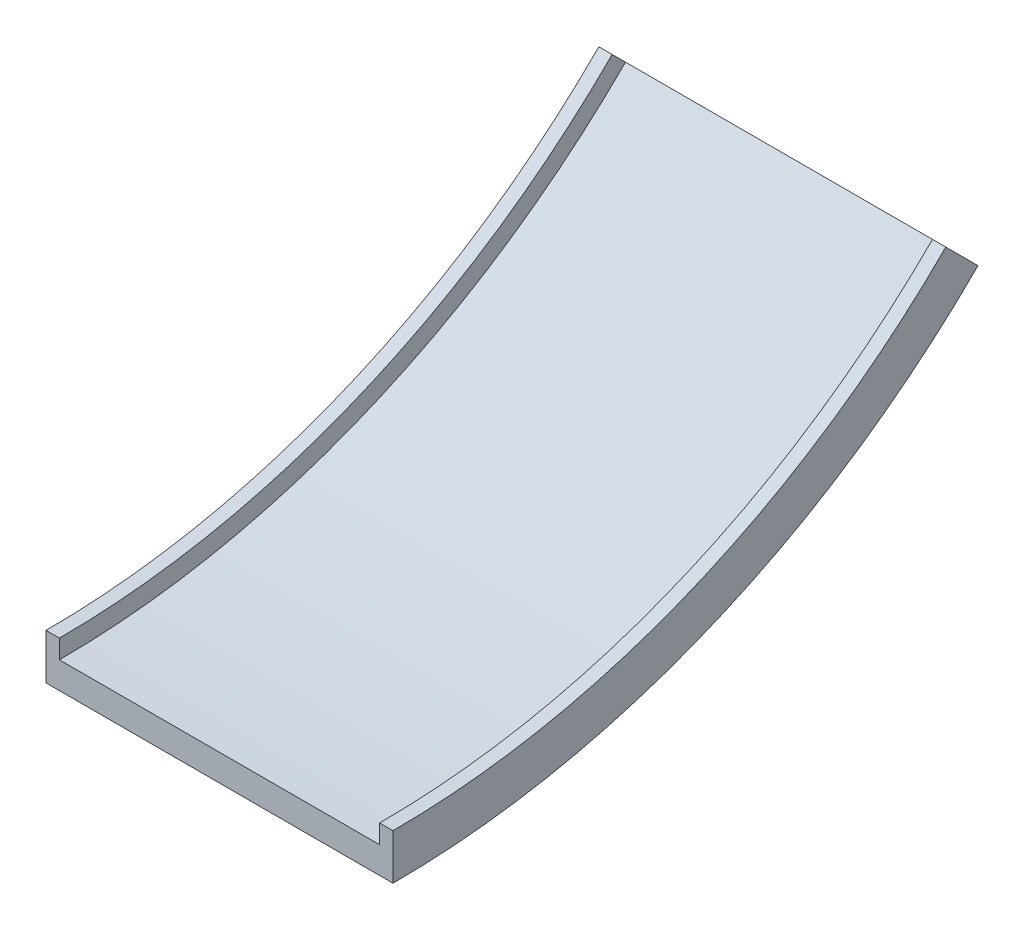
ISO-10303-21;
HEADER;
FILE_DESCRIPTION(('STEP AP214'),'2;1');
FILE_NAME('part.step','',(''),(''),'','','');
FILE_SCHEMA(('AUTOMOTIVE_DESIGN { 1 0 10303 214 1 1 1 1 }'));
ENDSEC;
DATA;
#1=APPLICATION_CONTEXT('core data for automotive mechanical design processes');
#2=APPLICATION_PROTOCOL_DEFINITION('international standard','automotive_design',2000,#1);
#3=PRODUCT_CONTEXT('',#1,'mechanical');
#4=PRODUCT('Part','Part','',(#3));
#5=PRODUCT_RELATED_PRODUCT_CATEGORY('part','',(#4));
#6=PRODUCT_DEFINITION_FORMATION('','',#4);
#7=PRODUCT_DEFINITION_CONTEXT('part definition',#1,'design');
#8=PRODUCT_DEFINITION('design','',#6,#7);
#9=PRODUCT_DEFINITION_SHAPE('','',#8);
#10=(LENGTH_UNIT() NAMED_UNIT(*) SI_UNIT(.MILLI.,.METRE.));
#11=(NAMED_UNIT(*) PLANE_ANGLE_UNIT() SI_UNIT($,.RADIAN.));
#12=(NAMED_UNIT(*) SI_UNIT($,.STERADIAN.) SOLID_ANGLE_UNIT());
#13=UNCERTAINTY_MEASURE_WITH_UNIT(LENGTH_MEASURE(1.E-05),#10,'distance_accuracy_value','');
#14=(GEOMETRIC_REPRESENTATION_CONTEXT(3) GLOBAL_UNCERTAINTY_ASSIGNED_CONTEXT((#13)) GLOBAL_UNIT_ASSIGNED_CONTEXT((#10,
#11,#12)) REPRESENTATION_CONTEXT('',''));
#15=CARTESIAN_POINT('',(0.,0.,0.));
#16=DIRECTION('',(0.,0.,1.));
#17=DIRECTION('',(1.,0.,0.));
#18=AXIS2_PLACEMENT_3D('',#15,#16,#17);
#19=CARTESIAN_POINT('',(1.68943504694732E-13,429.01941881872,-1035.74449943357));
#20=DIRECTION('',(1.,0.,0.));
#21=DIRECTION('',(0.,1.,0.));
#22=AXIS2_PLACEMENT_3D('',#19,#20,#21);
#23=PLANE('',#22);
#24=CARTESIAN_POINT('',(5.4514859527136E-13,1464.76391825229,0.));
#25=DIRECTION('',(-1.,0.,0.));
#26=DIRECTION('',(0.,-1.,0.));
#27=AXIS2_PLACEMENT_3D('',#24,#25,#26);
#28=CIRCLE('',#27,1550.);
#29=CARTESIAN_POINT('',(1.70741932046768E-13,368.748407413144,-1096.01551083915));
#30=VERTEX_POINT('',#29);
#31=CARTESIAN_POINT('',(0.,-85.2360817477096,0.));
#32=VERTEX_POINT('',#31);
#33=EDGE_CURVE('E11',#30,#32,#28,.T.);
#34=ORIENTED_EDGE('',*,*,#33,.T.);
#35=DIRECTION('',(0.,1.,0.));
#36=VECTOR('',#35,1.);
#37=CARTESIAN_POINT('',(0.,0.,0.));
#38=LINE('',#37,#36);
#39=CARTESIAN_POINT('',(0.,0.,0.));
#40=VERTEX_POINT('',#39);
#41=EDGE_CURVE('E99',#32,#40,#38,.T.);
#42=ORIENTED_EDGE('',*,*,#41,.T.);
#43=CARTESIAN_POINT('',(5.00373731595032E-13,1464.76391825229,0.));
#44=DIRECTION('',(-1.,0.,0.));
#45=DIRECTION('',(0.,-1.,0.));
#46=AXIS2_PLACEMENT_3D('',#43,#44,#45);
#47=CIRCLE('',#46,1464.76391825229);
#48=CARTESIAN_POINT('',(1.46556072856568E-13,429.01941881872,-1035.74449943357));
#49=VERTEX_POINT('',#48);
#50=EDGE_CURVE('E50',#49,#40,#47,.T.);
#51=ORIENTED_EDGE('',*,*,#50,.F.);
#52=DIRECTION('',(0.,0.707106781186546,0.707106781186549));
#53=VECTOR('',#52,1.);
#54=CARTESIAN_POINT('',(1.46556072856568E-13,429.01941881872,-1035.74449943357));
#55=LINE('',#54,#53);
#56=EDGE_CURVE('E101',#30,#49,#55,.T.);
#57=ORIENTED_EDGE('',*,*,#56,.F.);
#58=EDGE_LOOP('',(#34,#42,#51,#57));
#59=FACE_BOUND('',#58,.T.);
#60=ADVANCED_FACE('F35',(#59),#23,.F.);
#61=CARTESIAN_POINT('',(0.,1464.76391825229,0.));
#62=DIRECTION('',(-1.,0.,0.));
#63=DIRECTION('',(0.,-1.,0.));
#64=AXIS2_PLACEMENT_3D('',#61,#62,#63);
#65=CYLINDRICAL_SURFACE('',#64,1550.);
#66=CARTESIAN_POINT('',(650.,1464.76391825229,0.));
#67=DIRECTION('',(-1.,0.,0.));
#68=DIRECTION('',(0.,-1.,0.));
#69=AXIS2_PLACEMENT_3D('',#66,#67,#68);
#70=CIRCLE('',#69,1550.);
#71=CARTESIAN_POINT('',(650.,368.748407413143,-1096.01551083915));
#72=VERTEX_POINT('',#71);
#73=CARTESIAN_POINT('',(650.,-85.2360817477097,0.));
#74=VERTEX_POINT('',#73);
#75=EDGE_CURVE('E43',#72,#74,#70,.T.);
#76=ORIENTED_EDGE('',*,*,#75,.T.);
#77=DIRECTION('',(-1.,0.,0.));
#78=VECTOR('',#77,1.);
#79=CARTESIAN_POINT('',(0.,-85.2360817477096,0.));
#80=LINE('',#79,#78);
#81=EDGE_CURVE('E110',#74,#32,#80,.T.);
#82=ORIENTED_EDGE('',*,*,#81,.T.);
#83=ORIENTED_EDGE('',*,*,#33,.F.);
#84=DIRECTION('',(-1.,0.,0.));
#85=VECTOR('',#84,1.);
#86=CARTESIAN_POINT('',(1.45985177319219E-13,368.748407413144,-1096.01551083915));
#87=LINE('',#86,#85);
#88=EDGE_CURVE('E133',#72,#30,#87,.T.);
#89=ORIENTED_EDGE('',*,*,#88,.F.);
#90=EDGE_LOOP('',(#76,#82,#83,#89));
#91=FACE_BOUND('',#90,.T.);
#92=ADVANCED_FACE('F37',(#91),#65,.T.);
#93=CARTESIAN_POINT('',(650.,429.01941881872,-1035.74449943357));
#94=DIRECTION('',(-1.,0.,0.));
#95=DIRECTION('',(0.,-1.,0.));
#96=AXIS2_PLACEMENT_3D('',#93,#94,#95);
#97=PLANE('',#96);
#98=CARTESIAN_POINT('',(650.,1464.76391825229,0.));
#99=DIRECTION('',(-1.,0.,0.));
#100=DIRECTION('',(0.,-1.,0.));
#101=AXIS2_PLACEMENT_3D('',#98,#99,#100);
#102=CIRCLE('',#101,1464.76391825229);
#103=CARTESIAN_POINT('',(650.,429.01941881872,-1035.74449943357));
#104=VERTEX_POINT('',#103);
#105=CARTESIAN_POINT('',(650.,0.,0.));
#106=VERTEX_POINT('',#105);
#107=EDGE_CURVE('E161',#104,#106,#102,.T.);
#108=ORIENTED_EDGE('',*,*,#107,.T.);
#109=DIRECTION('',(0.,-1.,0.));
#110=VECTOR('',#109,1.);
#111=CARTESIAN_POINT('',(650.,0.,0.));
#112=LINE('',#111,#110);
#113=EDGE_CURVE('E115',#106,#74,#112,.T.);
#114=ORIENTED_EDGE('',*,*,#113,.T.);
#115=ORIENTED_EDGE('',*,*,#75,.F.);
#116=DIRECTION('',(0.,-0.707106781186546,-0.707106781186549));
#117=VECTOR('',#116,1.);
#118=CARTESIAN_POINT('',(650.,429.01941881872,-1035.74449943357));
#119=LINE('',#118,#117);
#120=EDGE_CURVE('E135',#104,#72,#119,.T.);
#121=ORIENTED_EDGE('',*,*,#120,.F.);
#122=EDGE_LOOP('',(#108,#114,#115,#121));
#123=FACE_BOUND('',#122,.T.);
#124=ADVANCED_FACE('F164',(#123),#97,.F.);
#125=CARTESIAN_POINT('',(0.,1464.76391825229,0.));
#126=DIRECTION('',(-1.,0.,0.));
#127=DIRECTION('',(0.,-1.,0.));
#128=AXIS2_PLACEMENT_3D('',#125,#126,#127);
#129=CYLINDRICAL_SURFACE('',#128,1464.76391825229);
#130=CARTESIAN_POINT('',(625.,1464.76391825229,0.));
#131=DIRECTION('',(-1.,0.,0.));
#132=DIRECTION('',(0.,-1.,0.));
#133=AXIS2_PLACEMENT_3D('',#130,#131,#132);
#134=CIRCLE('',#133,1464.76391825229);
#135=CARTESIAN_POINT('',(625.,429.01941881872,-1035.74449943357));
#136=VERTEX_POINT('',#135);
#137=CARTESIAN_POINT('',(625.,0.,0.));
#138=VERTEX_POINT('',#137);
#139=EDGE_CURVE('E159',#136,#138,#134,.T.);
#140=ORIENTED_EDGE('',*,*,#139,.T.);
#141=DIRECTION('',(1.,0.,0.));
#142=VECTOR('',#141,1.);
#143=CARTESIAN_POINT('',(0.,0.,0.));
#144=LINE('',#143,#142);
#145=EDGE_CURVE('E117',#138,#106,#144,.T.);
#146=ORIENTED_EDGE('',*,*,#145,.T.);
#147=ORIENTED_EDGE('',*,*,#107,.F.);
#148=DIRECTION('',(1.,0.,0.));
#149=VECTOR('',#148,1.);
#150=CARTESIAN_POINT('',(1.46556072856568E-13,429.01941881872,-1035.74449943357));
#151=LINE('',#150,#149);
#152=EDGE_CURVE('E138',#136,#104,#151,.T.);
#153=ORIENTED_EDGE('',*,*,#152,.F.);
#154=EDGE_LOOP('',(#140,#146,#147,#153));
#155=FACE_BOUND('',#154,.T.);
#156=ADVANCED_FACE('F169',(#155),#129,.F.);
#157=CARTESIAN_POINT('',(625.,429.01941881872,-1035.74449943357));
#158=DIRECTION('',(1.,0.,0.));
#159=DIRECTION('',(0.,1.,0.));
#160=AXIS2_PLACEMENT_3D('',#157,#158,#159);
#161=PLANE('',#160);
#162=CARTESIAN_POINT('',(625.,1464.76391825229,0.));
#163=DIRECTION('',(-1.,0.,0.));
#164=DIRECTION('',(0.,-1.,0.));
#165=AXIS2_PLACEMENT_3D('',#162,#163,#164);
#166=CIRCLE('',#165,1500.);
#167=CARTESIAN_POINT('',(625.,404.103746472471,-1060.66017177982));
#168=VERTEX_POINT('',#167);
#169=CARTESIAN_POINT('',(625.,-35.2360817477097,0.));
#170=VERTEX_POINT('',#169);
#171=EDGE_CURVE('E157',#168,#170,#166,.T.);
#172=ORIENTED_EDGE('',*,*,#171,.T.);
#173=DIRECTION('',(0.,1.,0.));
#174=VECTOR('',#173,1.);
#175=CARTESIAN_POINT('',(625.,0.,0.));
#176=LINE('',#175,#174);
#177=EDGE_CURVE('E122',#170,#138,#176,.T.);
#178=ORIENTED_EDGE('',*,*,#177,.T.);
#179=ORIENTED_EDGE('',*,*,#139,.F.);
#180=DIRECTION('',(0.,0.707106781186546,0.707106781186549));
#181=VECTOR('',#180,1.);
#182=CARTESIAN_POINT('',(625.,429.01941881872,-1035.74449943357));
#183=LINE('',#182,#181);
#184=EDGE_CURVE('E141',#168,#136,#183,.T.);
#185=ORIENTED_EDGE('',*,*,#184,.F.);
#186=EDGE_LOOP('',(#172,#178,#179,#185));
#187=FACE_BOUND('',#186,.T.);
#188=ADVANCED_FACE('F172',(#187),#161,.F.);
#189=CARTESIAN_POINT('',(0.,1464.76391825229,0.));
#190=DIRECTION('',(-1.,0.,0.));
#191=DIRECTION('',(0.,-1.,0.));
#192=AXIS2_PLACEMENT_3D('',#189,#190,#191);
#193=CYLINDRICAL_SURFACE('',#192,1500.);
#194=CARTESIAN_POINT('',(25.0000000000005,1464.76391825229,0.));
#195=DIRECTION('',(-1.,0.,0.));
#196=DIRECTION('',(0.,-1.,0.));
#197=AXIS2_PLACEMENT_3D('',#194,#195,#196);
#198=CIRCLE('',#197,1500.);
#199=CARTESIAN_POINT('',(25.0000000000002,404.103746472471,-1060.66017177982));
#200=VERTEX_POINT('',#199);
#201=CARTESIAN_POINT('',(25.,-35.2360817477097,0.));
#202=VERTEX_POINT('',#201);
#203=EDGE_CURVE('E155',#200,#202,#198,.T.);
#204=ORIENTED_EDGE('',*,*,#203,.T.);
#205=DIRECTION('',(1.,0.,0.));
#206=VECTOR('',#205,1.);
#207=CARTESIAN_POINT('',(0.,-35.2360817477097,0.));
#208=LINE('',#207,#206);
#209=EDGE_CURVE('E125',#202,#170,#208,.T.);
#210=ORIENTED_EDGE('',*,*,#209,.T.);
#211=ORIENTED_EDGE('',*,*,#171,.F.);
#212=DIRECTION('',(1.,0.,0.));
#213=VECTOR('',#212,1.);
#214=CARTESIAN_POINT('',(1.50081597823048E-13,404.103746472471,-1060.66017177982));
#215=LINE('',#214,#213);
#216=EDGE_CURVE('E144',#200,#168,#215,.T.);
#217=ORIENTED_EDGE('',*,*,#216,.F.);
#218=EDGE_LOOP('',(#204,#210,#211,#217));
#219=FACE_BOUND('',#218,.T.);
#220=ADVANCED_FACE('F175',(#219),#193,.F.);
#221=CARTESIAN_POINT('',(25.0000000000002,429.01941881872,-1035.74449943357));
#222=DIRECTION('',(-1.,0.,0.));
#223=DIRECTION('',(0.,-1.,0.));
#224=AXIS2_PLACEMENT_3D('',#221,#222,#223);
#225=PLANE('',#224);
#226=CARTESIAN_POINT('',(25.0000000000005,1464.76391825229,0.));
#227=DIRECTION('',(-1.,0.,0.));
#228=DIRECTION('',(0.,-1.,0.));
#229=AXIS2_PLACEMENT_3D('',#226,#227,#228);
#230=CIRCLE('',#229,1464.76391825229);
#231=CARTESIAN_POINT('',(25.0000000000001,429.01941881872,-1035.74449943357));
#232=VERTEX_POINT('',#231);
#233=CARTESIAN_POINT('',(25.,0.,0.));
#234=VERTEX_POINT('',#233);
#235=EDGE_CURVE('E58',#232,#234,#230,.T.);
#236=ORIENTED_EDGE('',*,*,#235,.T.);
#237=DIRECTION('',(0.,-1.,0.));
#238=VECTOR('',#237,1.);
#239=CARTESIAN_POINT('',(25.,0.,0.));
#240=LINE('',#239,#238);
#241=EDGE_CURVE('E128',#234,#202,#240,.T.);
#242=ORIENTED_EDGE('',*,*,#241,.T.);
#243=ORIENTED_EDGE('',*,*,#203,.F.);
#244=DIRECTION('',(0.,-0.707106781186546,-0.707106781186549));
#245=VECTOR('',#244,1.);
#246=CARTESIAN_POINT('',(25.0000000000001,429.01941881872,-1035.74449943357));
#247=LINE('',#246,#245);
#248=EDGE_CURVE('E147',#232,#200,#247,.T.);
#249=ORIENTED_EDGE('',*,*,#248,.F.);
#250=EDGE_LOOP('',(#236,#242,#243,#249));
#251=FACE_BOUND('',#250,.T.);
#252=ADVANCED_FACE('F178',(#251),#225,.F.);
#253=CARTESIAN_POINT('',(0.,1464.76391825229,0.));
#254=DIRECTION('',(-1.,0.,0.));
#255=DIRECTION('',(0.,-1.,0.));
#256=AXIS2_PLACEMENT_3D('',#253,#254,#255);
#257=CYLINDRICAL_SURFACE('',#256,1464.76391825229);
#258=DIRECTION('',(1.,0.,0.));
#259=VECTOR('',#258,1.);
#260=CARTESIAN_POINT('',(1.46556072856568E-13,429.01941881872,-1035.74449943357));
#261=LINE('',#260,#259);
#262=EDGE_CURVE('E150',#49,#232,#261,.T.);
#263=ORIENTED_EDGE('',*,*,#262,.F.);
#264=ORIENTED_EDGE('',*,*,#50,.T.);
#265=DIRECTION('',(1.,0.,0.));
#266=VECTOR('',#265,1.);
#267=CARTESIAN_POINT('',(0.,0.,0.));
#268=LINE('',#267,#266);
#269=EDGE_CURVE('E113',#40,#234,#268,.T.);
#270=ORIENTED_EDGE('',*,*,#269,.T.);
#271=ORIENTED_EDGE('',*,*,#235,.F.);
#272=EDGE_LOOP('',(#263,#264,#270,#271));
#273=FACE_BOUND('',#272,.T.);
#274=ADVANCED_FACE('F179',(#273),#257,.F.);
#275=CARTESIAN_POINT('',(1.46556072856568E-13,429.01941881872,-1035.74449943357));
#276=DIRECTION('',(0.,-0.707106781186549,0.707106781186546));
#277=DIRECTION('',(1.,0.,0.));
#278=AXIS2_PLACEMENT_3D('',#275,#276,#277);
#279=PLANE('',#278);
#280=ORIENTED_EDGE('',*,*,#56,.T.);
#281=ORIENTED_EDGE('',*,*,#262,.T.);
#282=ORIENTED_EDGE('',*,*,#248,.T.);
#283=ORIENTED_EDGE('',*,*,#216,.T.);
#284=ORIENTED_EDGE('',*,*,#184,.T.);
#285=ORIENTED_EDGE('',*,*,#152,.T.);
#286=ORIENTED_EDGE('',*,*,#120,.T.);
#287=ORIENTED_EDGE('',*,*,#88,.T.);
#288=EDGE_LOOP('',(#280,#281,#282,#283,#284,#285,#286,#287));
#289=FACE_BOUND('',#288,.T.);
#290=ADVANCED_FACE('F181',(#289),#279,.F.);
#291=CARTESIAN_POINT('',(0.,0.,0.));
#292=DIRECTION('',(0.,0.,1.));
#293=DIRECTION('',(1.,0.,0.));
#294=AXIS2_PLACEMENT_3D('',#291,#292,#293);
#295=PLANE('',#294);
#296=ORIENTED_EDGE('',*,*,#41,.F.);
#297=ORIENTED_EDGE('',*,*,#81,.F.);
#298=ORIENTED_EDGE('',*,*,#113,.F.);
#299=ORIENTED_EDGE('',*,*,#145,.F.);
#300=ORIENTED_EDGE('',*,*,#177,.F.);
#301=ORIENTED_EDGE('',*,*,#209,.F.);
#302=ORIENTED_EDGE('',*,*,#241,.F.);
#303=ORIENTED_EDGE('',*,*,#269,.F.);
#304=EDGE_LOOP('',(#296,#297,#298,#299,#300,#301,#302,#303));
#305=FACE_BOUND('',#304,.T.);
#306=ADVANCED_FACE('F108',(#305),#295,.T.);
#307=CLOSED_SHELL('',(#60,#92,#124,#156,#188,#220,#252,#274,#290,#306));
#308=MANIFOLD_SOLID_BREP('B2',#307);
#309=ADVANCED_BREP_SHAPE_REPRESENTATION('',(#18,#308),#14);
#310=SHAPE_DEFINITION_REPRESENTATION(#9,#309);
ENDSEC;
END-ISO-10303-21;
